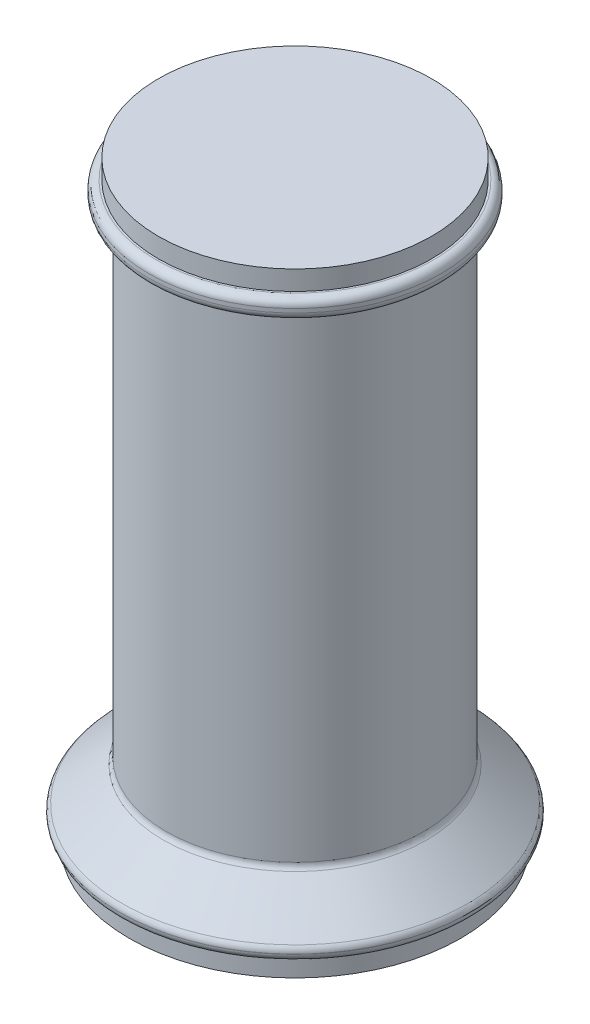
ISO-10303-21;
HEADER;
FILE_DESCRIPTION(('STEP AP214'),'2;1');
FILE_NAME('part.step','',(''),(''),'','','');
FILE_SCHEMA(('AUTOMOTIVE_DESIGN { 1 0 10303 214 1 1 1 1 }'));
ENDSEC;
DATA;
#1=APPLICATION_CONTEXT('core data for automotive mechanical design processes');
#2=APPLICATION_PROTOCOL_DEFINITION('international standard','automotive_design',2000,#1);
#3=PRODUCT_CONTEXT('',#1,'mechanical');
#4=PRODUCT('Part','Part','',(#3));
#5=PRODUCT_RELATED_PRODUCT_CATEGORY('part','',(#4));
#6=PRODUCT_DEFINITION_FORMATION('','',#4);
#7=PRODUCT_DEFINITION_CONTEXT('part definition',#1,'design');
#8=PRODUCT_DEFINITION('design','',#6,#7);
#9=PRODUCT_DEFINITION_SHAPE('','',#8);
#10=(LENGTH_UNIT() NAMED_UNIT(*) SI_UNIT(.MILLI.,.METRE.));
#11=(NAMED_UNIT(*) PLANE_ANGLE_UNIT() SI_UNIT($,.RADIAN.));
#12=(NAMED_UNIT(*) SI_UNIT($,.STERADIAN.) SOLID_ANGLE_UNIT());
#13=UNCERTAINTY_MEASURE_WITH_UNIT(LENGTH_MEASURE(1.E-05),#10,'distance_accuracy_value','');
#14=(GEOMETRIC_REPRESENTATION_CONTEXT(3) GLOBAL_UNCERTAINTY_ASSIGNED_CONTEXT((#13)) GLOBAL_UNIT_ASSIGNED_CONTEXT((#10,
#11,#12)) REPRESENTATION_CONTEXT('',''));
#15=CARTESIAN_POINT('',(0.,0.,0.));
#16=DIRECTION('',(0.,0.,1.));
#17=DIRECTION('',(1.,0.,0.));
#18=AXIS2_PLACEMENT_3D('',#15,#16,#17);
#19=CARTESIAN_POINT('',(0.,5.,0.));
#20=DIRECTION('',(0.,-1.,0.));
#21=DIRECTION('',(0.,0.,-1.));
#22=AXIS2_PLACEMENT_3D('',#19,#20,#21);
#23=CYLINDRICAL_SURFACE('',#22,42.5);
#24=CARTESIAN_POINT('',(0.,5.,0.));
#25=DIRECTION('',(0.,1.,0.));
#26=DIRECTION('',(0.,0.,1.));
#27=AXIS2_PLACEMENT_3D('',#24,#25,#26);
#28=CIRCLE('',#27,42.5);
#29=CARTESIAN_POINT('',(0.,5.,42.5));
#30=VERTEX_POINT('',#29);
#31=EDGE_CURVE('E90',#30,#30,#28,.T.);
#32=ORIENTED_EDGE('',*,*,#31,.F.);
#33=EDGE_LOOP('',(#32));
#34=FACE_BOUND('',#33,.T.);
#35=CARTESIAN_POINT('',(0.,0.,0.));
#36=DIRECTION('',(0.,1.,0.));
#37=DIRECTION('',(0.,0.,1.));
#38=AXIS2_PLACEMENT_3D('',#35,#36,#37);
#39=CIRCLE('',#38,42.5);
#40=CARTESIAN_POINT('',(0.,0.,42.5));
#41=VERTEX_POINT('',#40);
#42=EDGE_CURVE('E91',#41,#41,#39,.T.);
#43=ORIENTED_EDGE('',*,*,#42,.T.);
#44=EDGE_LOOP('',(#43));
#45=FACE_BOUND('',#44,.T.);
#46=ADVANCED_FACE('F46',(#34,#45),#23,.T.);
#47=CARTESIAN_POINT('',(0.,0.,0.));
#48=DIRECTION('',(0.,1.,0.));
#49=DIRECTION('',(0.,0.,1.));
#50=AXIS2_PLACEMENT_3D('',#47,#48,#49);
#51=PLANE('',#50);
#52=ORIENTED_EDGE('',*,*,#42,.F.);
#53=EDGE_LOOP('',(#52));
#54=FACE_BOUND('',#53,.T.);
#55=ADVANCED_FACE('F126',(#54),#51,.F.);
#56=CARTESIAN_POINT('',(0.,8.,0.));
#57=DIRECTION('',(0.,-1.,0.));
#58=DIRECTION('',(0.,0.,-1.));
#59=AXIS2_PLACEMENT_3D('',#56,#57,#58);
#60=CYLINDRICAL_SURFACE('',#59,45.);
#61=CARTESIAN_POINT('',(0.,7.,0.));
#62=DIRECTION('',(0.,1.,0.));
#63=DIRECTION('',(0.,0.,1.));
#64=AXIS2_PLACEMENT_3D('',#61,#62,#63);
#65=CIRCLE('',#64,45.);
#66=CARTESIAN_POINT('',(0.,7.,45.));
#67=VERTEX_POINT('',#66);
#68=EDGE_CURVE('E84',#67,#67,#65,.T.);
#69=ORIENTED_EDGE('',*,*,#68,.T.);
#70=EDGE_LOOP('',(#69));
#71=FACE_BOUND('',#70,.T.);
#72=CARTESIAN_POINT('',(0.,7.06325010803112,0.));
#73=DIRECTION('',(0.,-1.,0.));
#74=DIRECTION('',(0.,0.,-1.));
#75=AXIS2_PLACEMENT_3D('',#72,#73,#74);
#76=CIRCLE('',#75,45.);
#77=CARTESIAN_POINT('',(0.,7.06325010803112,-45.));
#78=VERTEX_POINT('',#77);
#79=EDGE_CURVE('E87',#78,#78,#76,.T.);
#80=ORIENTED_EDGE('',*,*,#79,.T.);
#81=EDGE_LOOP('',(#80));
#82=FACE_BOUND('',#81,.T.);
#83=ADVANCED_FACE('F132',(#71,#82),#60,.T.);
#84=CARTESIAN_POINT('',(0.,5.,0.));
#85=DIRECTION('',(0.,1.,0.));
#86=DIRECTION('',(0.,0.,1.));
#87=AXIS2_PLACEMENT_3D('',#84,#85,#86);
#88=PLANE('',#87);
#89=CARTESIAN_POINT('',(0.,5.,0.));
#90=DIRECTION('',(0.,1.,0.));
#91=DIRECTION('',(0.,0.,1.));
#92=AXIS2_PLACEMENT_3D('',#89,#90,#91);
#93=CIRCLE('',#92,43.);
#94=CARTESIAN_POINT('',(0.,5.,43.));
#95=VERTEX_POINT('',#94);
#96=EDGE_CURVE('E81',#95,#95,#93,.F.);
#97=ORIENTED_EDGE('',*,*,#96,.T.);
#98=EDGE_LOOP('',(#97));
#99=FACE_BOUND('',#98,.T.);
#100=ORIENTED_EDGE('',*,*,#31,.T.);
#101=EDGE_LOOP('',(#100));
#102=FACE_BOUND('',#101,.T.);
#103=ADVANCED_FACE('F238',(#99,#102),#88,.F.);
#104=CARTESIAN_POINT('',(0.,18.,0.));
#105=DIRECTION('',(0.,-1.,0.));
#106=DIRECTION('',(0.,0.,-1.));
#107=AXIS2_PLACEMENT_3D('',#104,#105,#106);
#108=CONICAL_SURFACE('',#107,33.,0.876058050598193);
#109=CARTESIAN_POINT('',(0.,8.59969266722588,0.));
#110=DIRECTION('',(0.,-1.,0.));
#111=DIRECTION('',(0.,0.,-1.));
#112=AXIS2_PLACEMENT_3D('',#109,#110,#111);
#113=CIRCLE('',#112,44.280368799329);
#114=CARTESIAN_POINT('',(0.,8.59969266722588,-44.280368799329));
#115=VERTEX_POINT('',#114);
#116=EDGE_CURVE('E75',#115,#115,#113,.F.);
#117=ORIENTED_EDGE('',*,*,#116,.T.);
#118=EDGE_LOOP('',(#117));
#119=FACE_BOUND('',#118,.T.);
#120=CARTESIAN_POINT('',(0.,17.4003073327741,0.));
#121=DIRECTION('',(0.,1.,0.));
#122=DIRECTION('',(0.,0.,1.));
#123=AXIS2_PLACEMENT_3D('',#120,#121,#122);
#124=CIRCLE('',#123,33.7196312006711);
#125=CARTESIAN_POINT('',(0.,17.4003073327741,33.7196312006711));
#126=VERTEX_POINT('',#125);
#127=EDGE_CURVE('E78',#126,#126,#124,.F.);
#128=ORIENTED_EDGE('',*,*,#127,.T.);
#129=EDGE_LOOP('',(#128));
#130=FACE_BOUND('',#129,.T.);
#131=ADVANCED_FACE('F229',(#119,#130),#108,.T.);
#132=CARTESIAN_POINT('',(0.,142.,0.));
#133=DIRECTION('',(0.,-1.,0.));
#134=DIRECTION('',(0.,0.,-1.));
#135=AXIS2_PLACEMENT_3D('',#132,#133,#134);
#136=CYLINDRICAL_SURFACE('',#135,33.);
#137=CARTESIAN_POINT('',(0.,140.,0.));
#138=DIRECTION('',(0.,1.,0.));
#139=DIRECTION('',(0.,0.,1.));
#140=AXIS2_PLACEMENT_3D('',#137,#138,#139);
#141=CIRCLE('',#140,33.);
#142=CARTESIAN_POINT('',(0.,140.,33.));
#143=VERTEX_POINT('',#142);
#144=EDGE_CURVE('E66',#143,#143,#141,.F.);
#145=ORIENTED_EDGE('',*,*,#144,.T.);
#146=EDGE_LOOP('',(#145));
#147=FACE_BOUND('',#146,.T.);
#148=CARTESIAN_POINT('',(0.,18.9367498919689,0.));
#149=DIRECTION('',(0.,1.,0.));
#150=DIRECTION('',(0.,0.,1.));
#151=AXIS2_PLACEMENT_3D('',#148,#149,#150);
#152=CIRCLE('',#151,33.);
#153=CARTESIAN_POINT('',(0.,18.9367498919689,33.));
#154=VERTEX_POINT('',#153);
#155=EDGE_CURVE('E69',#154,#154,#152,.T.);
#156=ORIENTED_EDGE('',*,*,#155,.T.);
#157=EDGE_LOOP('',(#156));
#158=FACE_BOUND('',#157,.T.);
#159=ADVANCED_FACE('F122',(#147,#158),#136,.T.);
#160=CARTESIAN_POINT('',(0.,147.,0.));
#161=DIRECTION('',(0.,-1.,0.));
#162=DIRECTION('',(0.,0.,-1.));
#163=AXIS2_PLACEMENT_3D('',#160,#161,#162);
#164=CYLINDRICAL_SURFACE('',#163,37.5);
#165=CARTESIAN_POINT('',(0.,144.,0.));
#166=DIRECTION('',(0.,1.,0.));
#167=DIRECTION('',(0.,0.,1.));
#168=AXIS2_PLACEMENT_3D('',#165,#166,#167);
#169=CIRCLE('',#168,37.5);
#170=CARTESIAN_POINT('',(0.,144.,37.5));
#171=VERTEX_POINT('',#170);
#172=EDGE_CURVE('E57',#171,#171,#169,.T.);
#173=ORIENTED_EDGE('',*,*,#172,.T.);
#174=EDGE_LOOP('',(#173));
#175=FACE_BOUND('',#174,.T.);
#176=CARTESIAN_POINT('',(0.,145.,0.));
#177=DIRECTION('',(0.,1.,0.));
#178=DIRECTION('',(0.,0.,1.));
#179=AXIS2_PLACEMENT_3D('',#176,#177,#178);
#180=CIRCLE('',#179,37.5);
#181=CARTESIAN_POINT('',(0.,145.,37.5));
#182=VERTEX_POINT('',#181);
#183=EDGE_CURVE('E61',#182,#182,#180,.F.);
#184=ORIENTED_EDGE('',*,*,#183,.T.);
#185=EDGE_LOOP('',(#184));
#186=FACE_BOUND('',#185,.T.);
#187=ADVANCED_FACE('F114',(#175,#186),#164,.T.);
#188=CARTESIAN_POINT('',(0.,147.,0.));
#189=DIRECTION('',(0.,1.,0.));
#190=DIRECTION('',(0.,0.,1.));
#191=AXIS2_PLACEMENT_3D('',#188,#189,#190);
#192=PLANE('',#191);
#193=CARTESIAN_POINT('',(0.,147.,0.));
#194=DIRECTION('',(0.,1.,0.));
#195=DIRECTION('',(0.,0.,1.));
#196=AXIS2_PLACEMENT_3D('',#193,#194,#195);
#197=CIRCLE('',#196,35.);
#198=CARTESIAN_POINT('',(0.,147.,35.));
#199=VERTEX_POINT('',#198);
#200=EDGE_CURVE('E97',#199,#199,#197,.T.);
#201=ORIENTED_EDGE('',*,*,#200,.F.);
#202=EDGE_LOOP('',(#201));
#203=FACE_BOUND('',#202,.T.);
#204=CARTESIAN_POINT('',(0.,147.,0.));
#205=DIRECTION('',(0.,1.,0.));
#206=DIRECTION('',(0.,0.,1.));
#207=AXIS2_PLACEMENT_3D('',#204,#205,#206);
#208=CIRCLE('',#207,35.5);
#209=CARTESIAN_POINT('',(0.,147.,35.5));
#210=VERTEX_POINT('',#209);
#211=EDGE_CURVE('E13',#210,#210,#208,.T.);
#212=ORIENTED_EDGE('',*,*,#211,.T.);
#213=EDGE_LOOP('',(#212));
#214=FACE_BOUND('',#213,.T.);
#215=ADVANCED_FACE('F111',(#203,#214),#192,.T.);
#216=CARTESIAN_POINT('',(0.,142.,0.));
#217=DIRECTION('',(0.,1.,0.));
#218=DIRECTION('',(0.,0.,1.));
#219=AXIS2_PLACEMENT_3D('',#216,#217,#218);
#220=PLANE('',#219);
#221=CARTESIAN_POINT('',(0.,142.,0.));
#222=DIRECTION('',(0.,1.,0.));
#223=DIRECTION('',(0.,0.,1.));
#224=AXIS2_PLACEMENT_3D('',#221,#222,#223);
#225=CIRCLE('',#224,35.5);
#226=CARTESIAN_POINT('',(0.,142.,35.5));
#227=VERTEX_POINT('',#226);
#228=EDGE_CURVE('E53',#227,#227,#225,.F.);
#229=ORIENTED_EDGE('',*,*,#228,.T.);
#230=EDGE_LOOP('',(#229));
#231=FACE_BOUND('',#230,.T.);
#232=CARTESIAN_POINT('',(0.,142.,0.));
#233=DIRECTION('',(0.,1.,0.));
#234=DIRECTION('',(0.,0.,1.));
#235=AXIS2_PLACEMENT_3D('',#232,#233,#234);
#236=CIRCLE('',#235,35.);
#237=CARTESIAN_POINT('',(0.,142.,35.));
#238=VERTEX_POINT('',#237);
#239=EDGE_CURVE('E72',#238,#238,#236,.T.);
#240=ORIENTED_EDGE('',*,*,#239,.T.);
#241=EDGE_LOOP('',(#240));
#242=FACE_BOUND('',#241,.T.);
#243=ADVANCED_FACE('F113',(#231,#242),#220,.F.);
#244=CARTESIAN_POINT('',(0.,7.,0.));
#245=DIRECTION('',(0.,1.,0.));
#246=DIRECTION('',(0.,0.,1.));
#247=AXIS2_PLACEMENT_3D('',#244,#245,#246);
#248=TOROIDAL_SURFACE('',#247,43.,2.);
#249=ORIENTED_EDGE('',*,*,#96,.F.);
#250=EDGE_LOOP('',(#249));
#251=FACE_BOUND('',#250,.T.);
#252=ORIENTED_EDGE('',*,*,#68,.F.);
#253=EDGE_LOOP('',(#252));
#254=FACE_BOUND('',#253,.T.);
#255=ADVANCED_FACE('F120',(#251,#254),#248,.T.);
#256=CARTESIAN_POINT('',(0.,7.06325010803112,0.));
#257=DIRECTION('',(0.,-1.,0.));
#258=DIRECTION('',(0.,0.,-1.));
#259=AXIS2_PLACEMENT_3D('',#256,#257,#258);
#260=TOROIDAL_SURFACE('',#259,43.,2.);
#261=ORIENTED_EDGE('',*,*,#79,.F.);
#262=EDGE_LOOP('',(#261));
#263=FACE_BOUND('',#262,.T.);
#264=ORIENTED_EDGE('',*,*,#116,.F.);
#265=EDGE_LOOP('',(#264));
#266=FACE_BOUND('',#265,.T.);
#267=ADVANCED_FACE('F141',(#263,#266),#260,.T.);
#268=CARTESIAN_POINT('',(0.,140.,0.));
#269=DIRECTION('',(0.,1.,0.));
#270=DIRECTION('',(0.,0.,1.));
#271=AXIS2_PLACEMENT_3D('',#268,#269,#270);
#272=TOROIDAL_SURFACE('',#271,35.,2.);
#273=ORIENTED_EDGE('',*,*,#144,.F.);
#274=EDGE_LOOP('',(#273));
#275=FACE_BOUND('',#274,.T.);
#276=ORIENTED_EDGE('',*,*,#239,.F.);
#277=EDGE_LOOP('',(#276));
#278=FACE_BOUND('',#277,.T.);
#279=ADVANCED_FACE('F145',(#275,#278),#272,.F.);
#280=CARTESIAN_POINT('',(0.,18.9367498919689,0.));
#281=DIRECTION('',(0.,1.,0.));
#282=DIRECTION('',(0.,0.,1.));
#283=AXIS2_PLACEMENT_3D('',#280,#281,#282);
#284=TOROIDAL_SURFACE('',#283,35.,2.);
#285=ORIENTED_EDGE('',*,*,#127,.F.);
#286=EDGE_LOOP('',(#285));
#287=FACE_BOUND('',#286,.T.);
#288=ORIENTED_EDGE('',*,*,#155,.F.);
#289=EDGE_LOOP('',(#288));
#290=FACE_BOUND('',#289,.T.);
#291=ADVANCED_FACE('F149',(#287,#290),#284,.F.);
#292=CARTESIAN_POINT('',(0.,144.,0.));
#293=DIRECTION('',(0.,1.,0.));
#294=DIRECTION('',(0.,0.,1.));
#295=AXIS2_PLACEMENT_3D('',#292,#293,#294);
#296=TOROIDAL_SURFACE('',#295,35.5,2.);
#297=ORIENTED_EDGE('',*,*,#228,.F.);
#298=EDGE_LOOP('',(#297));
#299=FACE_BOUND('',#298,.T.);
#300=ORIENTED_EDGE('',*,*,#172,.F.);
#301=EDGE_LOOP('',(#300));
#302=FACE_BOUND('',#301,.T.);
#303=ADVANCED_FACE('F152',(#299,#302),#296,.T.);
#304=CARTESIAN_POINT('',(0.,145.,0.));
#305=DIRECTION('',(0.,1.,0.));
#306=DIRECTION('',(0.,0.,1.));
#307=AXIS2_PLACEMENT_3D('',#304,#305,#306);
#308=TOROIDAL_SURFACE('',#307,35.5,2.);
#309=ORIENTED_EDGE('',*,*,#183,.F.);
#310=EDGE_LOOP('',(#309));
#311=FACE_BOUND('',#310,.T.);
#312=ORIENTED_EDGE('',*,*,#211,.F.);
#313=EDGE_LOOP('',(#312));
#314=FACE_BOUND('',#313,.T.);
#315=ADVANCED_FACE('F48',(#311,#314),#308,.T.);
#316=CARTESIAN_POINT('',(0.,152.,0.));
#317=DIRECTION('',(0.,-1.,0.));
#318=DIRECTION('',(0.,0.,-1.));
#319=AXIS2_PLACEMENT_3D('',#316,#317,#318);
#320=CYLINDRICAL_SURFACE('',#319,35.);
#321=CARTESIAN_POINT('',(0.,152.,0.));
#322=DIRECTION('',(0.,1.,0.));
#323=DIRECTION('',(0.,0.,1.));
#324=AXIS2_PLACEMENT_3D('',#321,#322,#323);
#325=CIRCLE('',#324,35.);
#326=CARTESIAN_POINT('',(0.,152.,35.));
#327=VERTEX_POINT('',#326);
#328=EDGE_CURVE('E94',#327,#327,#325,.T.);
#329=ORIENTED_EDGE('',*,*,#328,.F.);
#330=EDGE_LOOP('',(#329));
#331=FACE_BOUND('',#330,.T.);
#332=ORIENTED_EDGE('',*,*,#200,.T.);
#333=EDGE_LOOP('',(#332));
#334=FACE_BOUND('',#333,.T.);
#335=ADVANCED_FACE('F105',(#331,#334),#320,.T.);
#336=CARTESIAN_POINT('',(0.,152.,0.));
#337=DIRECTION('',(0.,1.,0.));
#338=DIRECTION('',(0.,0.,1.));
#339=AXIS2_PLACEMENT_3D('',#336,#337,#338);
#340=PLANE('',#339);
#341=ORIENTED_EDGE('',*,*,#328,.T.);
#342=EDGE_LOOP('',(#341));
#343=FACE_BOUND('',#342,.T.);
#344=ADVANCED_FACE('F103',(#343),#340,.T.);
#345=CLOSED_SHELL('',(#46,#55,#83,#103,#131,#159,#187,#215,#243,#255,#267,#279,#291,#303,#315,
#335,#344));
#346=MANIFOLD_SOLID_BREP('B2',#345);
#347=ADVANCED_BREP_SHAPE_REPRESENTATION('',(#18,#346),#14);
#348=SHAPE_DEFINITION_REPRESENTATION(#9,#347);
ENDSEC;
END-ISO-10303-21;
